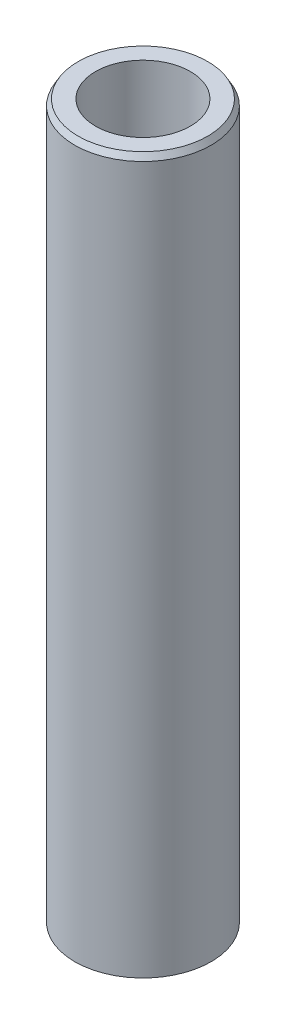
ISO-10303-21;
HEADER;
FILE_DESCRIPTION(('STEP AP214'),'2;1');
FILE_NAME('part.step','',(''),(''),'','','');
FILE_SCHEMA(('AUTOMOTIVE_DESIGN { 1 0 10303 214 1 1 1 1 }'));
ENDSEC;
DATA;
#1=APPLICATION_CONTEXT('core data for automotive mechanical design processes');
#2=APPLICATION_PROTOCOL_DEFINITION('international standard','automotive_design',2000,#1);
#3=PRODUCT_CONTEXT('',#1,'mechanical');
#4=PRODUCT('Part','Part','',(#3));
#5=PRODUCT_RELATED_PRODUCT_CATEGORY('part','',(#4));
#6=PRODUCT_DEFINITION_FORMATION('','',#4);
#7=PRODUCT_DEFINITION_CONTEXT('part definition',#1,'design');
#8=PRODUCT_DEFINITION('design','',#6,#7);
#9=PRODUCT_DEFINITION_SHAPE('','',#8);
#10=(LENGTH_UNIT() NAMED_UNIT(*) SI_UNIT(.MILLI.,.METRE.));
#11=(NAMED_UNIT(*) PLANE_ANGLE_UNIT() SI_UNIT($,.RADIAN.));
#12=(NAMED_UNIT(*) SI_UNIT($,.STERADIAN.) SOLID_ANGLE_UNIT());
#13=UNCERTAINTY_MEASURE_WITH_UNIT(LENGTH_MEASURE(1.E-05),#10,'distance_accuracy_value','');
#14=(GEOMETRIC_REPRESENTATION_CONTEXT(3) GLOBAL_UNCERTAINTY_ASSIGNED_CONTEXT((#13)) GLOBAL_UNIT_ASSIGNED_CONTEXT((#10,
#11,#12)) REPRESENTATION_CONTEXT('',''));
#15=CARTESIAN_POINT('',(0.,0.,0.));
#16=DIRECTION('',(0.,0.,1.));
#17=DIRECTION('',(1.,0.,0.));
#18=AXIS2_PLACEMENT_3D('',#15,#16,#17);
#19=CARTESIAN_POINT('',(0.,105.042365515922,0.));
#20=DIRECTION('',(0.,-1.,0.));
#21=DIRECTION('',(0.,0.,-1.));
#22=AXIS2_PLACEMENT_3D('',#19,#20,#21);
#23=CYLINDRICAL_SURFACE('',#22,10.);
#24=CARTESIAN_POINT('',(0.,104.154344308622,0.));
#25=DIRECTION('',(0.,1.,0.));
#26=DIRECTION('',(0.,0.,1.));
#27=AXIS2_PLACEMENT_3D('',#24,#25,#26);
#28=CIRCLE('',#27,10.);
#29=CARTESIAN_POINT('',(0.,104.154344308622,10.));
#30=VERTEX_POINT('',#29);
#31=EDGE_CURVE('E50',#30,#30,#28,.F.);
#32=ORIENTED_EDGE('',*,*,#31,.T.);
#33=EDGE_LOOP('',(#32));
#34=FACE_BOUND('',#33,.T.);
#35=CARTESIAN_POINT('',(0.,0.512699283080398,0.));
#36=DIRECTION('',(0.,1.,0.));
#37=DIRECTION('',(0.,0.,1.));
#38=AXIS2_PLACEMENT_3D('',#35,#36,#37);
#39=CIRCLE('',#38,10.);
#40=CARTESIAN_POINT('',(0.,0.512699283080398,10.));
#41=VERTEX_POINT('',#40);
#42=EDGE_CURVE('E51',#41,#41,#39,.T.);
#43=ORIENTED_EDGE('',*,*,#42,.T.);
#44=EDGE_LOOP('',(#43));
#45=FACE_BOUND('',#44,.T.);
#46=ADVANCED_FACE('F39',(#34,#45),#23,.T.);
#47=CARTESIAN_POINT('',(0.,105.042365515922,0.));
#48=DIRECTION('',(0.,1.,0.));
#49=DIRECTION('',(0.,0.,1.));
#50=AXIS2_PLACEMENT_3D('',#47,#48,#49);
#51=PLANE('',#50);
#52=CARTESIAN_POINT('',(0.,105.042365515922,0.));
#53=DIRECTION('',(0.,1.,0.));
#54=DIRECTION('',(0.,0.,1.));
#55=AXIS2_PLACEMENT_3D('',#52,#53,#54);
#56=CIRCLE('',#55,9.4873007169196);
#57=CARTESIAN_POINT('',(0.,105.042365515922,9.4873007169196));
#58=VERTEX_POINT('',#57);
#59=EDGE_CURVE('E54',#58,#58,#56,.T.);
#60=ORIENTED_EDGE('',*,*,#59,.T.);
#61=EDGE_LOOP('',(#60));
#62=FACE_BOUND('',#61,.T.);
#63=CARTESIAN_POINT('',(0.,105.042365515922,0.));
#64=DIRECTION('',(0.,1.,0.));
#65=DIRECTION('',(0.,0.,1.));
#66=AXIS2_PLACEMENT_3D('',#63,#64,#65);
#67=CIRCLE('',#66,6.94778231283408);
#68=CARTESIAN_POINT('',(0.,105.042365515922,6.94778231283408));
#69=VERTEX_POINT('',#68);
#70=EDGE_CURVE('E58',#69,#69,#67,.T.);
#71=ORIENTED_EDGE('',*,*,#70,.F.);
#72=EDGE_LOOP('',(#71));
#73=FACE_BOUND('',#72,.T.);
#74=ADVANCED_FACE('F69',(#62,#73),#51,.T.);
#75=CARTESIAN_POINT('',(0.,0.,0.));
#76=DIRECTION('',(0.,1.,0.));
#77=DIRECTION('',(0.,0.,1.));
#78=AXIS2_PLACEMENT_3D('',#75,#76,#77);
#79=PLANE('',#78);
#80=CARTESIAN_POINT('',(0.,0.,0.));
#81=DIRECTION('',(0.,1.,0.));
#82=DIRECTION('',(0.,0.,1.));
#83=AXIS2_PLACEMENT_3D('',#80,#81,#82);
#84=CIRCLE('',#83,9.11197879270062);
#85=CARTESIAN_POINT('',(0.,0.,9.11197879270062));
#86=VERTEX_POINT('',#85);
#87=EDGE_CURVE('E10',#86,#86,#84,.F.);
#88=ORIENTED_EDGE('',*,*,#87,.T.);
#89=EDGE_LOOP('',(#88));
#90=FACE_BOUND('',#89,.T.);
#91=CARTESIAN_POINT('',(0.,0.,0.));
#92=DIRECTION('',(0.,1.,0.));
#93=DIRECTION('',(0.,0.,1.));
#94=AXIS2_PLACEMENT_3D('',#91,#92,#93);
#95=CIRCLE('',#94,6.94778231283408);
#96=CARTESIAN_POINT('',(0.,0.,6.94778231283408));
#97=VERTEX_POINT('',#96);
#98=EDGE_CURVE('E63',#97,#97,#95,.T.);
#99=ORIENTED_EDGE('',*,*,#98,.T.);
#100=EDGE_LOOP('',(#99));
#101=FACE_BOUND('',#100,.T.);
#102=ADVANCED_FACE('F75',(#90,#101),#79,.F.);
#103=CARTESIAN_POINT('',(0.,105.042365515922,0.));
#104=DIRECTION('',(0.,-1.,0.));
#105=DIRECTION('',(0.,0.,-1.));
#106=AXIS2_PLACEMENT_3D('',#103,#104,#105);
#107=CYLINDRICAL_SURFACE('',#106,6.94778231283408);
#108=ORIENTED_EDGE('',*,*,#70,.T.);
#109=EDGE_LOOP('',(#108));
#110=FACE_BOUND('',#109,.T.);
#111=ORIENTED_EDGE('',*,*,#98,.F.);
#112=EDGE_LOOP('',(#111));
#113=FACE_BOUND('',#112,.T.);
#114=ADVANCED_FACE('F70',(#110,#113),#107,.F.);
#115=CARTESIAN_POINT('',(0.,105.042365515922,0.));
#116=DIRECTION('',(0.,-1.,0.));
#117=DIRECTION('',(0.,0.,-1.));
#118=AXIS2_PLACEMENT_3D('',#115,#116,#117);
#119=CONICAL_SURFACE('',#118,9.4873007169196,0.523598775598297);
#120=ORIENTED_EDGE('',*,*,#31,.F.);
#121=EDGE_LOOP('',(#120));
#122=FACE_BOUND('',#121,.T.);
#123=ORIENTED_EDGE('',*,*,#59,.F.);
#124=EDGE_LOOP('',(#123));
#125=FACE_BOUND('',#124,.T.);
#126=ADVANCED_FACE('F81',(#122,#125),#119,.T.);
#127=CARTESIAN_POINT('',(0.,0.512699283080398,0.));
#128=DIRECTION('',(0.,1.,0.));
#129=DIRECTION('',(0.,0.,1.));
#130=AXIS2_PLACEMENT_3D('',#127,#128,#129);
#131=CONICAL_SURFACE('',#130,10.,1.04719755119659);
#132=ORIENTED_EDGE('',*,*,#87,.F.);
#133=EDGE_LOOP('',(#132));
#134=FACE_BOUND('',#133,.T.);
#135=ORIENTED_EDGE('',*,*,#42,.F.);
#136=EDGE_LOOP('',(#135));
#137=FACE_BOUND('',#136,.T.);
#138=ADVANCED_FACE('F45',(#134,#137),#131,.T.);
#139=CLOSED_SHELL('',(#46,#74,#102,#114,#126,#138));
#140=MANIFOLD_SOLID_BREP('B2',#139);
#141=ADVANCED_BREP_SHAPE_REPRESENTATION('',(#18,#140),#14);
#142=SHAPE_DEFINITION_REPRESENTATION(#9,#141);
ENDSEC;
END-ISO-10303-21;
